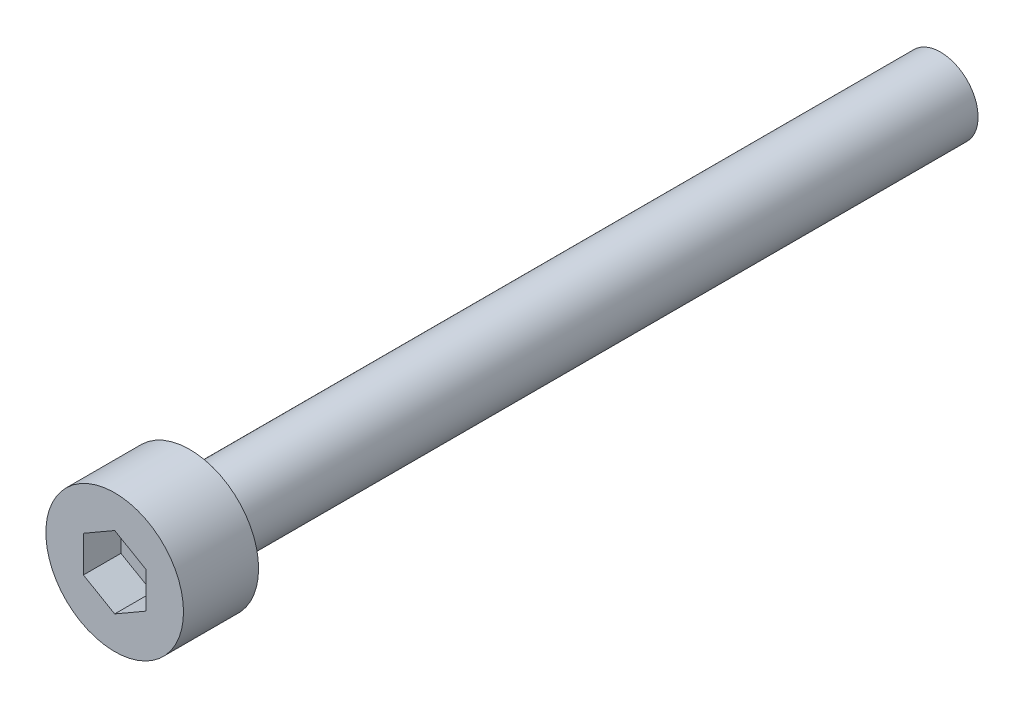
ISO-10303-21;
HEADER;
FILE_DESCRIPTION(('STEP AP214'),'2;1');
FILE_NAME('part.step','',(''),(''),'','','');
FILE_SCHEMA(('AUTOMOTIVE_DESIGN { 1 0 10303 214 1 1 1 1 }'));
ENDSEC;
DATA;
#1=APPLICATION_CONTEXT('core data for automotive mechanical design processes');
#2=APPLICATION_PROTOCOL_DEFINITION('international standard','automotive_design',2000,#1);
#3=PRODUCT_CONTEXT('',#1,'mechanical');
#4=PRODUCT('Part','Part','',(#3));
#5=PRODUCT_RELATED_PRODUCT_CATEGORY('part','',(#4));
#6=PRODUCT_DEFINITION_FORMATION('','',#4);
#7=PRODUCT_DEFINITION_CONTEXT('part definition',#1,'design');
#8=PRODUCT_DEFINITION('design','',#6,#7);
#9=PRODUCT_DEFINITION_SHAPE('','',#8);
#10=(LENGTH_UNIT() NAMED_UNIT(*) SI_UNIT(.MILLI.,.METRE.));
#11=(NAMED_UNIT(*) PLANE_ANGLE_UNIT() SI_UNIT($,.RADIAN.));
#12=(NAMED_UNIT(*) SI_UNIT($,.STERADIAN.) SOLID_ANGLE_UNIT());
#13=UNCERTAINTY_MEASURE_WITH_UNIT(LENGTH_MEASURE(1.E-05),#10,'distance_accuracy_value','');
#14=(GEOMETRIC_REPRESENTATION_CONTEXT(3) GLOBAL_UNCERTAINTY_ASSIGNED_CONTEXT((#13)) GLOBAL_UNIT_ASSIGNED_CONTEXT((#10,
#11,#12)) REPRESENTATION_CONTEXT('',''));
#15=CARTESIAN_POINT('',(0.,0.,0.));
#16=DIRECTION('',(0.,0.,1.));
#17=DIRECTION('',(1.,0.,0.));
#18=AXIS2_PLACEMENT_3D('',#15,#16,#17);
#19=CARTESIAN_POINT('',(0.,0.,3.));
#20=DIRECTION('',(0.,0.,-1.));
#21=DIRECTION('',(-1.,0.,0.));
#22=AXIS2_PLACEMENT_3D('',#19,#20,#21);
#23=CYLINDRICAL_SURFACE('',#22,2.75);
#24=CARTESIAN_POINT('',(0.,0.,3.));
#25=DIRECTION('',(0.,0.,1.));
#26=DIRECTION('',(1.,0.,0.));
#27=AXIS2_PLACEMENT_3D('',#24,#25,#26);
#28=CIRCLE('',#27,2.75);
#29=CARTESIAN_POINT('',(2.75,0.,3.));
#30=VERTEX_POINT('',#29);
#31=EDGE_CURVE('E52',#30,#30,#28,.T.);
#32=ORIENTED_EDGE('',*,*,#31,.F.);
#33=EDGE_LOOP('',(#32));
#34=FACE_BOUND('',#33,.T.);
#35=CARTESIAN_POINT('',(0.,0.,0.));
#36=DIRECTION('',(0.,0.,1.));
#37=DIRECTION('',(1.,0.,0.));
#38=AXIS2_PLACEMENT_3D('',#35,#36,#37);
#39=CIRCLE('',#38,2.75);
#40=CARTESIAN_POINT('',(2.75,0.,0.));
#41=VERTEX_POINT('',#40);
#42=EDGE_CURVE('E46',#41,#41,#39,.T.);
#43=ORIENTED_EDGE('',*,*,#42,.T.);
#44=EDGE_LOOP('',(#43));
#45=FACE_BOUND('',#44,.T.);
#46=ADVANCED_FACE('F43',(#34,#45),#23,.T.);
#47=CARTESIAN_POINT('',(0.,0.,3.));
#48=DIRECTION('',(0.,0.,1.));
#49=DIRECTION('',(1.,0.,0.));
#50=AXIS2_PLACEMENT_3D('',#47,#48,#49);
#51=PLANE('',#50);
#52=DIRECTION('',(0.866025403784439,-0.5,0.));
#53=VECTOR('',#52,1.);
#54=CARTESIAN_POINT('',(-1.25,-0.721687836487032,3.));
#55=LINE('',#54,#53);
#56=CARTESIAN_POINT('',(-1.25,-0.721687836487032,3.));
#57=VERTEX_POINT('',#56);
#58=CARTESIAN_POINT('',(0.,-1.44337567297406,3.));
#59=VERTEX_POINT('',#58);
#60=EDGE_CURVE('E60',#57,#59,#55,.T.);
#61=ORIENTED_EDGE('',*,*,#60,.F.);
#62=DIRECTION('',(0.,-1.,0.));
#63=VECTOR('',#62,1.);
#64=CARTESIAN_POINT('',(-1.25,0.721687836487032,3.));
#65=LINE('',#64,#63);
#66=CARTESIAN_POINT('',(-1.25,0.721687836487032,3.));
#67=VERTEX_POINT('',#66);
#68=EDGE_CURVE('E154',#67,#57,#65,.T.);
#69=ORIENTED_EDGE('',*,*,#68,.F.);
#70=DIRECTION('',(-0.866025403784438,-0.5,0.));
#71=VECTOR('',#70,1.);
#72=CARTESIAN_POINT('',(0.,1.44337567297407,3.));
#73=LINE('',#72,#71);
#74=CARTESIAN_POINT('',(0.,1.44337567297407,3.));
#75=VERTEX_POINT('',#74);
#76=EDGE_CURVE('E151',#75,#67,#73,.T.);
#77=ORIENTED_EDGE('',*,*,#76,.F.);
#78=DIRECTION('',(-0.866025403784439,0.5,0.));
#79=VECTOR('',#78,1.);
#80=CARTESIAN_POINT('',(1.25,0.721687836487033,3.));
#81=LINE('',#80,#79);
#82=CARTESIAN_POINT('',(1.25,0.721687836487033,3.));
#83=VERTEX_POINT('',#82);
#84=EDGE_CURVE('E108',#83,#75,#81,.T.);
#85=ORIENTED_EDGE('',*,*,#84,.F.);
#86=DIRECTION('',(0.,1.,0.));
#87=VECTOR('',#86,1.);
#88=CARTESIAN_POINT('',(1.25,-0.721687836487032,3.));
#89=LINE('',#88,#87);
#90=CARTESIAN_POINT('',(1.25,-0.721687836487032,3.));
#91=VERTEX_POINT('',#90);
#92=EDGE_CURVE('E145',#91,#83,#89,.T.);
#93=ORIENTED_EDGE('',*,*,#92,.F.);
#94=DIRECTION('',(0.866025403784439,0.5,0.));
#95=VECTOR('',#94,1.);
#96=CARTESIAN_POINT('',(0.,-1.44337567297406,3.));
#97=LINE('',#96,#95);
#98=EDGE_CURVE('E140',#59,#91,#97,.T.);
#99=ORIENTED_EDGE('',*,*,#98,.F.);
#100=EDGE_LOOP('',(#61,#69,#77,#85,#93,#99));
#101=FACE_BOUND('',#100,.T.);
#102=ORIENTED_EDGE('',*,*,#31,.T.);
#103=EDGE_LOOP('',(#102));
#104=FACE_BOUND('',#103,.T.);
#105=ADVANCED_FACE('F180',(#101,#104),#51,.T.);
#106=CARTESIAN_POINT('',(0.,0.,0.));
#107=DIRECTION('',(0.,0.,1.));
#108=DIRECTION('',(1.,0.,0.));
#109=AXIS2_PLACEMENT_3D('',#106,#107,#108);
#110=PLANE('',#109);
#111=CARTESIAN_POINT('',(0.,0.,0.));
#112=DIRECTION('',(0.,0.,-1.));
#113=DIRECTION('',(-1.,0.,0.));
#114=AXIS2_PLACEMENT_3D('',#111,#112,#113);
#115=CIRCLE('',#114,1.5);
#116=CARTESIAN_POINT('',(-1.5,0.,0.));
#117=VERTEX_POINT('',#116);
#118=EDGE_CURVE('E11',#117,#117,#115,.T.);
#119=ORIENTED_EDGE('',*,*,#118,.F.);
#120=EDGE_LOOP('',(#119));
#121=FACE_BOUND('',#120,.T.);
#122=ORIENTED_EDGE('',*,*,#42,.F.);
#123=EDGE_LOOP('',(#122));
#124=FACE_BOUND('',#123,.T.);
#125=ADVANCED_FACE('F177',(#121,#124),#110,.F.);
#126=CARTESIAN_POINT('',(-1.25,-0.721687836487032,1.5));
#127=DIRECTION('',(-0.5,-0.866025403784439,0.));
#128=DIRECTION('',(0.866025403784439,-0.5,0.));
#129=AXIS2_PLACEMENT_3D('',#126,#127,#128);
#130=PLANE('',#129);
#131=ORIENTED_EDGE('',*,*,#60,.T.);
#132=DIRECTION('',(0.,0.,1.));
#133=VECTOR('',#132,1.);
#134=CARTESIAN_POINT('',(0.,-1.44337567297406,1.5));
#135=LINE('',#134,#133);
#136=CARTESIAN_POINT('',(0.,-1.44337567297406,1.5));
#137=VERTEX_POINT('',#136);
#138=EDGE_CURVE('E90',#137,#59,#135,.T.);
#139=ORIENTED_EDGE('',*,*,#138,.F.);
#140=DIRECTION('',(0.866025403784439,-0.5,0.));
#141=VECTOR('',#140,1.);
#142=CARTESIAN_POINT('',(-1.25,-0.721687836487032,1.5));
#143=LINE('',#142,#141);
#144=CARTESIAN_POINT('',(-1.25,-0.721687836487032,1.5));
#145=VERTEX_POINT('',#144);
#146=EDGE_CURVE('E157',#145,#137,#143,.T.);
#147=ORIENTED_EDGE('',*,*,#146,.F.);
#148=DIRECTION('',(0.,0.,1.));
#149=VECTOR('',#148,1.);
#150=CARTESIAN_POINT('',(-1.25,-0.721687836487032,1.5));
#151=LINE('',#150,#149);
#152=EDGE_CURVE('E68',#145,#57,#151,.T.);
#153=ORIENTED_EDGE('',*,*,#152,.T.);
#154=EDGE_LOOP('',(#131,#139,#147,#153));
#155=FACE_BOUND('',#154,.T.);
#156=ADVANCED_FACE('F179',(#155),#130,.F.);
#157=CARTESIAN_POINT('',(-1.25,0.721687836487032,1.5));
#158=DIRECTION('',(-1.,0.,0.));
#159=DIRECTION('',(0.,0.,1.));
#160=AXIS2_PLACEMENT_3D('',#157,#158,#159);
#161=PLANE('',#160);
#162=ORIENTED_EDGE('',*,*,#68,.T.);
#163=ORIENTED_EDGE('',*,*,#152,.F.);
#164=DIRECTION('',(0.,-1.,0.));
#165=VECTOR('',#164,1.);
#166=CARTESIAN_POINT('',(-1.25,0.721687836487032,1.5));
#167=LINE('',#166,#165);
#168=CARTESIAN_POINT('',(-1.25,0.721687836487032,1.5));
#169=VERTEX_POINT('',#168);
#170=EDGE_CURVE('E122',#169,#145,#167,.T.);
#171=ORIENTED_EDGE('',*,*,#170,.F.);
#172=DIRECTION('',(0.,0.,1.));
#173=VECTOR('',#172,1.);
#174=CARTESIAN_POINT('',(-1.25,0.721687836487032,1.5));
#175=LINE('',#174,#173);
#176=EDGE_CURVE('E113',#169,#67,#175,.T.);
#177=ORIENTED_EDGE('',*,*,#176,.T.);
#178=EDGE_LOOP('',(#162,#163,#171,#177));
#179=FACE_BOUND('',#178,.T.);
#180=ADVANCED_FACE('F186',(#179),#161,.F.);
#181=CARTESIAN_POINT('',(0.,1.44337567297407,1.5));
#182=DIRECTION('',(-0.5,0.866025403784439,0.));
#183=DIRECTION('',(-0.866025403784439,-0.5,0.));
#184=AXIS2_PLACEMENT_3D('',#181,#182,#183);
#185=PLANE('',#184);
#186=ORIENTED_EDGE('',*,*,#76,.T.);
#187=ORIENTED_EDGE('',*,*,#176,.F.);
#188=DIRECTION('',(-0.866025403784438,-0.5,0.));
#189=VECTOR('',#188,1.);
#190=CARTESIAN_POINT('',(0.,1.44337567297407,1.5));
#191=LINE('',#190,#189);
#192=CARTESIAN_POINT('',(0.,1.44337567297407,1.5));
#193=VERTEX_POINT('',#192);
#194=EDGE_CURVE('E117',#193,#169,#191,.T.);
#195=ORIENTED_EDGE('',*,*,#194,.F.);
#196=DIRECTION('',(0.,0.,1.));
#197=VECTOR('',#196,1.);
#198=CARTESIAN_POINT('',(0.,1.44337567297407,1.5));
#199=LINE('',#198,#197);
#200=EDGE_CURVE('E101',#193,#75,#199,.T.);
#201=ORIENTED_EDGE('',*,*,#200,.T.);
#202=EDGE_LOOP('',(#186,#187,#195,#201));
#203=FACE_BOUND('',#202,.T.);
#204=ADVANCED_FACE('F118',(#203),#185,.F.);
#205=CARTESIAN_POINT('',(1.25,0.721687836487033,1.5));
#206=DIRECTION('',(0.5,0.866025403784439,0.));
#207=DIRECTION('',(-0.866025403784439,0.5,0.));
#208=AXIS2_PLACEMENT_3D('',#205,#206,#207);
#209=PLANE('',#208);
#210=ORIENTED_EDGE('',*,*,#84,.T.);
#211=ORIENTED_EDGE('',*,*,#200,.F.);
#212=DIRECTION('',(-0.866025403784439,0.5,0.));
#213=VECTOR('',#212,1.);
#214=CARTESIAN_POINT('',(1.25,0.721687836487033,1.5));
#215=LINE('',#214,#213);
#216=CARTESIAN_POINT('',(1.25,0.721687836487033,1.5));
#217=VERTEX_POINT('',#216);
#218=EDGE_CURVE('E105',#217,#193,#215,.T.);
#219=ORIENTED_EDGE('',*,*,#218,.F.);
#220=DIRECTION('',(0.,0.,1.));
#221=VECTOR('',#220,1.);
#222=CARTESIAN_POINT('',(1.25,0.721687836487033,1.5));
#223=LINE('',#222,#221);
#224=EDGE_CURVE('E114',#217,#83,#223,.T.);
#225=ORIENTED_EDGE('',*,*,#224,.T.);
#226=EDGE_LOOP('',(#210,#211,#219,#225));
#227=FACE_BOUND('',#226,.T.);
#228=ADVANCED_FACE('F103',(#227),#209,.F.);
#229=CARTESIAN_POINT('',(1.25,-0.721687836487032,1.5));
#230=DIRECTION('',(1.,0.,0.));
#231=DIRECTION('',(0.,1.,0.));
#232=AXIS2_PLACEMENT_3D('',#229,#230,#231);
#233=PLANE('',#232);
#234=ORIENTED_EDGE('',*,*,#92,.T.);
#235=ORIENTED_EDGE('',*,*,#224,.F.);
#236=DIRECTION('',(0.,1.,0.));
#237=VECTOR('',#236,1.);
#238=CARTESIAN_POINT('',(1.25,-0.721687836487032,1.5));
#239=LINE('',#238,#237);
#240=CARTESIAN_POINT('',(1.25,-0.721687836487032,1.5));
#241=VERTEX_POINT('',#240);
#242=EDGE_CURVE('E128',#241,#217,#239,.T.);
#243=ORIENTED_EDGE('',*,*,#242,.F.);
#244=DIRECTION('',(0.,0.,1.));
#245=VECTOR('',#244,1.);
#246=CARTESIAN_POINT('',(1.25,-0.721687836487032,1.5));
#247=LINE('',#246,#245);
#248=EDGE_CURVE('E164',#241,#91,#247,.T.);
#249=ORIENTED_EDGE('',*,*,#248,.T.);
#250=EDGE_LOOP('',(#234,#235,#243,#249));
#251=FACE_BOUND('',#250,.T.);
#252=ADVANCED_FACE('F235',(#251),#233,.F.);
#253=CARTESIAN_POINT('',(0.,-1.44337567297406,1.5));
#254=DIRECTION('',(0.5,-0.866025403784438,0.));
#255=DIRECTION('',(0.866025403784439,0.5,0.));
#256=AXIS2_PLACEMENT_3D('',#253,#254,#255);
#257=PLANE('',#256);
#258=ORIENTED_EDGE('',*,*,#98,.T.);
#259=ORIENTED_EDGE('',*,*,#248,.F.);
#260=DIRECTION('',(0.866025403784439,0.5,0.));
#261=VECTOR('',#260,1.);
#262=CARTESIAN_POINT('',(0.,-1.44337567297406,1.5));
#263=LINE('',#262,#261);
#264=EDGE_CURVE('E132',#137,#241,#263,.T.);
#265=ORIENTED_EDGE('',*,*,#264,.F.);
#266=ORIENTED_EDGE('',*,*,#138,.T.);
#267=EDGE_LOOP('',(#258,#259,#265,#266));
#268=FACE_BOUND('',#267,.T.);
#269=ADVANCED_FACE('F245',(#268),#257,.F.);
#270=CARTESIAN_POINT('',(0.,0.,1.5));
#271=DIRECTION('',(0.,0.,1.));
#272=DIRECTION('',(1.,0.,0.));
#273=AXIS2_PLACEMENT_3D('',#270,#271,#272);
#274=PLANE('',#273);
#275=ORIENTED_EDGE('',*,*,#146,.T.);
#276=ORIENTED_EDGE('',*,*,#264,.T.);
#277=ORIENTED_EDGE('',*,*,#242,.T.);
#278=ORIENTED_EDGE('',*,*,#218,.T.);
#279=ORIENTED_EDGE('',*,*,#194,.T.);
#280=ORIENTED_EDGE('',*,*,#170,.T.);
#281=EDGE_LOOP('',(#275,#276,#277,#278,#279,#280));
#282=FACE_BOUND('',#281,.T.);
#283=ADVANCED_FACE('F125',(#282),#274,.T.);
#284=CARTESIAN_POINT('',(0.,0.,-30.));
#285=DIRECTION('',(0.,0.,1.));
#286=DIRECTION('',(1.,0.,0.));
#287=AXIS2_PLACEMENT_3D('',#284,#285,#286);
#288=CYLINDRICAL_SURFACE('',#287,1.5);
#289=CARTESIAN_POINT('',(0.,0.,-30.));
#290=DIRECTION('',(0.,0.,-1.));
#291=DIRECTION('',(-1.,0.,0.));
#292=AXIS2_PLACEMENT_3D('',#289,#290,#291);
#293=CIRCLE('',#292,1.5);
#294=CARTESIAN_POINT('',(-1.5,0.,-30.));
#295=VERTEX_POINT('',#294);
#296=EDGE_CURVE('E141',#295,#295,#293,.T.);
#297=ORIENTED_EDGE('',*,*,#296,.F.);
#298=EDGE_LOOP('',(#297));
#299=FACE_BOUND('',#298,.T.);
#300=ORIENTED_EDGE('',*,*,#118,.T.);
#301=EDGE_LOOP('',(#300));
#302=FACE_BOUND('',#301,.T.);
#303=ADVANCED_FACE('F265',(#299,#302),#288,.T.);
#304=CARTESIAN_POINT('',(0.,0.,-30.));
#305=DIRECTION('',(0.,0.,-1.));
#306=DIRECTION('',(-1.,0.,0.));
#307=AXIS2_PLACEMENT_3D('',#304,#305,#306);
#308=PLANE('',#307);
#309=ORIENTED_EDGE('',*,*,#296,.T.);
#310=EDGE_LOOP('',(#309));
#311=FACE_BOUND('',#310,.T.);
#312=ADVANCED_FACE('F280',(#311),#308,.T.);
#313=CLOSED_SHELL('',(#46,#105,#125,#156,#180,#204,#228,#252,#269,#283,#303,#312));
#314=MANIFOLD_SOLID_BREP('B2',#313);
#315=ADVANCED_BREP_SHAPE_REPRESENTATION('',(#18,#314),#14);
#316=SHAPE_DEFINITION_REPRESENTATION(#9,#315);
ENDSEC;
END-ISO-10303-21;
